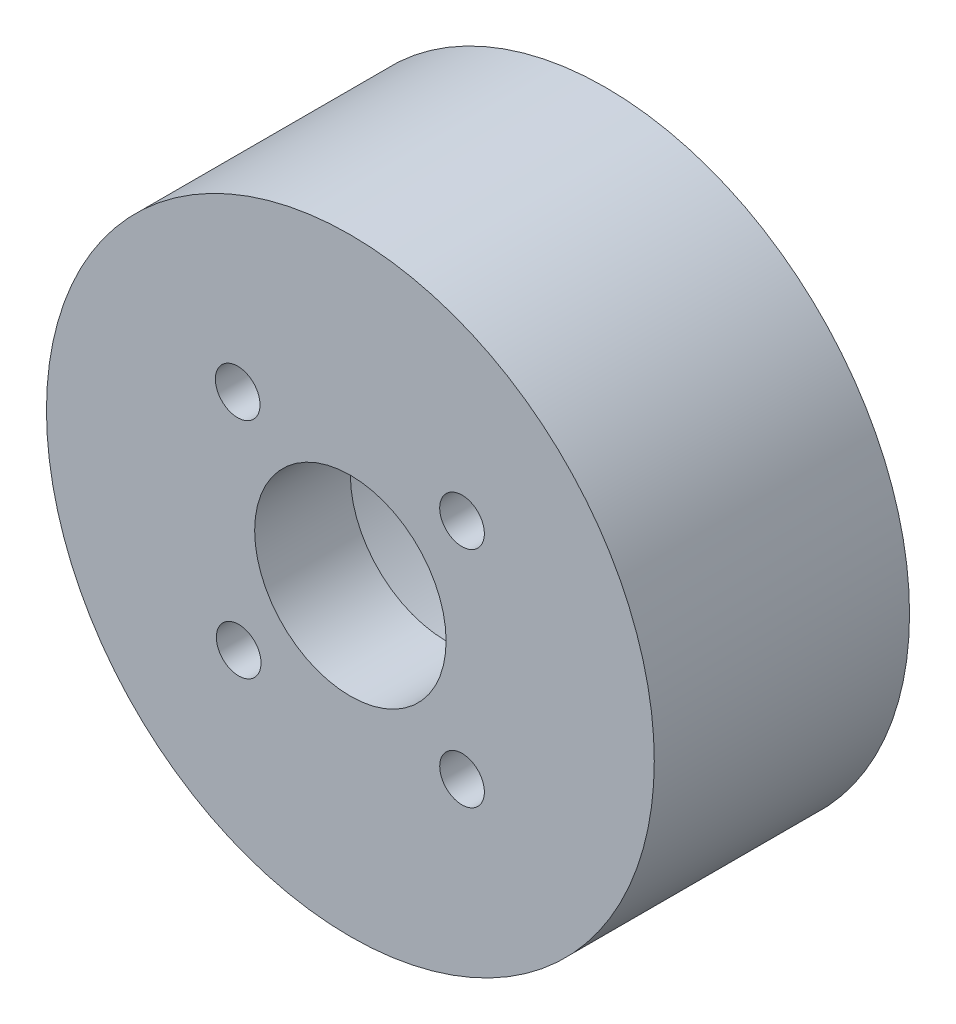
ISO-10303-21;
HEADER;
FILE_DESCRIPTION(('STEP AP214'),'2;1');
FILE_NAME('part.step','',(''),(''),'','','');
FILE_SCHEMA(('AUTOMOTIVE_DESIGN { 1 0 10303 214 1 1 1 1 }'));
ENDSEC;
DATA;
#1=APPLICATION_CONTEXT('core data for automotive mechanical design processes');
#2=APPLICATION_PROTOCOL_DEFINITION('international standard','automotive_design',2000,#1);
#3=PRODUCT_CONTEXT('',#1,'mechanical');
#4=PRODUCT('Part','Part','',(#3));
#5=PRODUCT_RELATED_PRODUCT_CATEGORY('part','',(#4));
#6=PRODUCT_DEFINITION_FORMATION('','',#4);
#7=PRODUCT_DEFINITION_CONTEXT('part definition',#1,'design');
#8=PRODUCT_DEFINITION('design','',#6,#7);
#9=PRODUCT_DEFINITION_SHAPE('','',#8);
#10=(LENGTH_UNIT() NAMED_UNIT(*) SI_UNIT(.MILLI.,.METRE.));
#11=(NAMED_UNIT(*) PLANE_ANGLE_UNIT() SI_UNIT($,.RADIAN.));
#12=(NAMED_UNIT(*) SI_UNIT($,.STERADIAN.) SOLID_ANGLE_UNIT());
#13=UNCERTAINTY_MEASURE_WITH_UNIT(LENGTH_MEASURE(1.E-05),#10,'distance_accuracy_value','');
#14=(GEOMETRIC_REPRESENTATION_CONTEXT(3) GLOBAL_UNCERTAINTY_ASSIGNED_CONTEXT((#13)) GLOBAL_UNIT_ASSIGNED_CONTEXT((#10,
#11,#12)) REPRESENTATION_CONTEXT('',''));
#15=CARTESIAN_POINT('',(0.,0.,0.));
#16=DIRECTION('',(0.,0.,1.));
#17=DIRECTION('',(1.,0.,0.));
#18=AXIS2_PLACEMENT_3D('',#15,#16,#17);
#19=CARTESIAN_POINT('',(0.,0.,16.));
#20=DIRECTION('',(0.,0.,-1.));
#21=DIRECTION('',(-1.,0.,0.));
#22=AXIS2_PLACEMENT_3D('',#19,#20,#21);
#23=CYLINDRICAL_SURFACE('',#22,19.05);
#24=CARTESIAN_POINT('',(0.,0.,16.));
#25=DIRECTION('',(0.,0.,1.));
#26=DIRECTION('',(1.,0.,0.));
#27=AXIS2_PLACEMENT_3D('',#24,#25,#26);
#28=CIRCLE('',#27,19.05);
#29=CARTESIAN_POINT('',(19.05,0.,16.));
#30=VERTEX_POINT('',#29);
#31=EDGE_CURVE('E10',#30,#30,#28,.T.);
#32=ORIENTED_EDGE('',*,*,#31,.F.);
#33=EDGE_LOOP('',(#32));
#34=FACE_BOUND('',#33,.T.);
#35=CARTESIAN_POINT('',(0.,0.,0.));
#36=DIRECTION('',(0.,0.,1.));
#37=DIRECTION('',(1.,0.,0.));
#38=AXIS2_PLACEMENT_3D('',#35,#36,#37);
#39=CIRCLE('',#38,19.05);
#40=CARTESIAN_POINT('',(19.05,0.,0.));
#41=VERTEX_POINT('',#40);
#42=EDGE_CURVE('E40',#41,#41,#39,.T.);
#43=ORIENTED_EDGE('',*,*,#42,.T.);
#44=EDGE_LOOP('',(#43));
#45=FACE_BOUND('',#44,.T.);
#46=ADVANCED_FACE('F37',(#34,#45),#23,.T.);
#47=CARTESIAN_POINT('',(0.,0.,16.));
#48=DIRECTION('',(0.,0.,1.));
#49=DIRECTION('',(1.,0.,0.));
#50=AXIS2_PLACEMENT_3D('',#47,#48,#49);
#51=PLANE('',#50);
#52=CARTESIAN_POINT('',(0.,0.,16.));
#53=DIRECTION('',(0.,0.,-1.));
#54=DIRECTION('',(-1.,0.,0.));
#55=AXIS2_PLACEMENT_3D('',#52,#53,#54);
#56=CIRCLE('',#55,6.);
#57=CARTESIAN_POINT('',(-6.,0.,16.));
#58=VERTEX_POINT('',#57);
#59=EDGE_CURVE('E119',#58,#58,#56,.T.);
#60=ORIENTED_EDGE('',*,*,#59,.T.);
#61=EDGE_LOOP('',(#60));
#62=FACE_BOUND('',#61,.T.);
#63=CARTESIAN_POINT('',(-7.,-7.,16.));
#64=DIRECTION('',(0.,0.,-1.));
#65=DIRECTION('',(-1.,0.,0.));
#66=AXIS2_PLACEMENT_3D('',#63,#64,#65);
#67=CIRCLE('',#66,1.4);
#68=CARTESIAN_POINT('',(-8.4,-7.,16.));
#69=VERTEX_POINT('',#68);
#70=EDGE_CURVE('E111',#69,#69,#67,.T.);
#71=ORIENTED_EDGE('',*,*,#70,.T.);
#72=EDGE_LOOP('',(#71));
#73=FACE_BOUND('',#72,.T.);
#74=CARTESIAN_POINT('',(7.,-7.,16.));
#75=DIRECTION('',(0.,0.,-1.));
#76=DIRECTION('',(-1.,0.,0.));
#77=AXIS2_PLACEMENT_3D('',#74,#75,#76);
#78=CIRCLE('',#77,1.4);
#79=CARTESIAN_POINT('',(5.6,-7.,16.));
#80=VERTEX_POINT('',#79);
#81=EDGE_CURVE('E103',#80,#80,#78,.T.);
#82=ORIENTED_EDGE('',*,*,#81,.T.);
#83=EDGE_LOOP('',(#82));
#84=FACE_BOUND('',#83,.T.);
#85=CARTESIAN_POINT('',(-7.06265710847331,6.98642658204118,16.));
#86=DIRECTION('',(0.,0.,-1.));
#87=DIRECTION('',(-1.,0.,0.));
#88=AXIS2_PLACEMENT_3D('',#85,#86,#87);
#89=CIRCLE('',#88,1.4);
#90=CARTESIAN_POINT('',(-8.46265710847331,6.98642658204118,16.));
#91=VERTEX_POINT('',#90);
#92=EDGE_CURVE('E95',#91,#91,#89,.T.);
#93=ORIENTED_EDGE('',*,*,#92,.T.);
#94=EDGE_LOOP('',(#93));
#95=FACE_BOUND('',#94,.T.);
#96=CARTESIAN_POINT('',(6.99800237830717,7.01997713227787,16.));
#97=DIRECTION('',(0.,0.,-1.));
#98=DIRECTION('',(-1.,0.,0.));
#99=AXIS2_PLACEMENT_3D('',#96,#97,#98);
#100=CIRCLE('',#99,1.4);
#101=CARTESIAN_POINT('',(5.59800237830717,7.01997713227787,16.));
#102=VERTEX_POINT('',#101);
#103=EDGE_CURVE('E72',#102,#102,#100,.T.);
#104=ORIENTED_EDGE('',*,*,#103,.T.);
#105=EDGE_LOOP('',(#104));
#106=FACE_BOUND('',#105,.T.);
#107=ORIENTED_EDGE('',*,*,#31,.T.);
#108=EDGE_LOOP('',(#107));
#109=FACE_BOUND('',#108,.T.);
#110=ADVANCED_FACE('F131',(#62,#73,#84,#95,#106,#109),#51,.T.);
#111=CARTESIAN_POINT('',(0.,0.,0.));
#112=DIRECTION('',(0.,0.,1.));
#113=DIRECTION('',(1.,0.,0.));
#114=AXIS2_PLACEMENT_3D('',#111,#112,#113);
#115=PLANE('',#114);
#116=CARTESIAN_POINT('',(0.,0.,0.));
#117=DIRECTION('',(0.,0.,-1.));
#118=DIRECTION('',(-1.,0.,0.));
#119=AXIS2_PLACEMENT_3D('',#116,#117,#118);
#120=CIRCLE('',#119,15.4);
#121=CARTESIAN_POINT('',(-15.4,0.,0.));
#122=VERTEX_POINT('',#121);
#123=EDGE_CURVE('E51',#122,#122,#120,.T.);
#124=ORIENTED_EDGE('',*,*,#123,.F.);
#125=EDGE_LOOP('',(#124));
#126=FACE_BOUND('',#125,.T.);
#127=ORIENTED_EDGE('',*,*,#42,.F.);
#128=EDGE_LOOP('',(#127));
#129=FACE_BOUND('',#128,.T.);
#130=ADVANCED_FACE('F159',(#126,#129),#115,.F.);
#131=CARTESIAN_POINT('',(0.,0.,10.));
#132=DIRECTION('',(0.,0.,-1.));
#133=DIRECTION('',(-1.,0.,0.));
#134=AXIS2_PLACEMENT_3D('',#131,#132,#133);
#135=CYLINDRICAL_SURFACE('',#134,15.4);
#136=CARTESIAN_POINT('',(0.,0.,10.));
#137=DIRECTION('',(0.,0.,-1.));
#138=DIRECTION('',(-1.,0.,0.));
#139=AXIS2_PLACEMENT_3D('',#136,#137,#138);
#140=CIRCLE('',#139,15.4);
#141=CARTESIAN_POINT('',(-15.4,0.,10.));
#142=VERTEX_POINT('',#141);
#143=EDGE_CURVE('E49',#142,#142,#140,.T.);
#144=ORIENTED_EDGE('',*,*,#143,.F.);
#145=EDGE_LOOP('',(#144));
#146=FACE_BOUND('',#145,.T.);
#147=ORIENTED_EDGE('',*,*,#123,.T.);
#148=EDGE_LOOP('',(#147));
#149=FACE_BOUND('',#148,.T.);
#150=ADVANCED_FACE('F145',(#146,#149),#135,.F.);
#151=CARTESIAN_POINT('',(0.,0.,10.));
#152=DIRECTION('',(0.,0.,-1.));
#153=DIRECTION('',(-1.,0.,0.));
#154=AXIS2_PLACEMENT_3D('',#151,#152,#153);
#155=PLANE('',#154);
#156=CARTESIAN_POINT('',(0.,0.,10.));
#157=DIRECTION('',(0.,0.,-1.));
#158=DIRECTION('',(-1.,0.,0.));
#159=AXIS2_PLACEMENT_3D('',#156,#157,#158);
#160=CIRCLE('',#159,6.);
#161=CARTESIAN_POINT('',(-6.,0.,10.));
#162=VERTEX_POINT('',#161);
#163=EDGE_CURVE('E123',#162,#162,#160,.T.);
#164=ORIENTED_EDGE('',*,*,#163,.F.);
#165=EDGE_LOOP('',(#164));
#166=FACE_BOUND('',#165,.T.);
#167=CARTESIAN_POINT('',(7.,-7.,10.));
#168=DIRECTION('',(0.,0.,-1.));
#169=DIRECTION('',(-1.,0.,0.));
#170=AXIS2_PLACEMENT_3D('',#167,#168,#169);
#171=CIRCLE('',#170,2.5);
#172=CARTESIAN_POINT('',(4.5,-7.,10.));
#173=VERTEX_POINT('',#172);
#174=EDGE_CURVE('E67',#173,#173,#171,.T.);
#175=ORIENTED_EDGE('',*,*,#174,.F.);
#176=EDGE_LOOP('',(#175));
#177=FACE_BOUND('',#176,.T.);
#178=CARTESIAN_POINT('',(-7.,-7.,10.));
#179=DIRECTION('',(0.,0.,-1.));
#180=DIRECTION('',(-1.,0.,0.));
#181=AXIS2_PLACEMENT_3D('',#178,#179,#180);
#182=CIRCLE('',#181,2.5);
#183=CARTESIAN_POINT('',(-9.5,-7.,10.));
#184=VERTEX_POINT('',#183);
#185=EDGE_CURVE('E76',#184,#184,#182,.T.);
#186=ORIENTED_EDGE('',*,*,#185,.F.);
#187=EDGE_LOOP('',(#186));
#188=FACE_BOUND('',#187,.T.);
#189=CARTESIAN_POINT('',(-7.,7.,10.));
#190=DIRECTION('',(0.,0.,-1.));
#191=DIRECTION('',(-1.,0.,0.));
#192=AXIS2_PLACEMENT_3D('',#189,#190,#191);
#193=CIRCLE('',#192,2.5);
#194=CARTESIAN_POINT('',(-9.5,7.,10.));
#195=VERTEX_POINT('',#194);
#196=EDGE_CURVE('E84',#195,#195,#193,.T.);
#197=ORIENTED_EDGE('',*,*,#196,.F.);
#198=EDGE_LOOP('',(#197));
#199=FACE_BOUND('',#198,.T.);
#200=CARTESIAN_POINT('',(7.,7.,10.));
#201=DIRECTION('',(0.,0.,-1.));
#202=DIRECTION('',(-1.,0.,0.));
#203=AXIS2_PLACEMENT_3D('',#200,#201,#202);
#204=CIRCLE('',#203,2.5);
#205=CARTESIAN_POINT('',(4.5,7.,10.));
#206=VERTEX_POINT('',#205);
#207=EDGE_CURVE('E59',#206,#206,#204,.T.);
#208=ORIENTED_EDGE('',*,*,#207,.F.);
#209=EDGE_LOOP('',(#208));
#210=FACE_BOUND('',#209,.T.);
#211=ORIENTED_EDGE('',*,*,#143,.T.);
#212=EDGE_LOOP('',(#211));
#213=FACE_BOUND('',#212,.T.);
#214=ADVANCED_FACE('F141',(#166,#177,#188,#199,#210,#213),#155,.T.);
#215=CARTESIAN_POINT('',(7.,7.,11.4));
#216=DIRECTION('',(0.,0.,-1.));
#217=DIRECTION('',(-1.,0.,0.));
#218=AXIS2_PLACEMENT_3D('',#215,#216,#217);
#219=CYLINDRICAL_SURFACE('',#218,2.5);
#220=CARTESIAN_POINT('',(7.,7.,11.4));
#221=DIRECTION('',(0.,0.,-1.));
#222=DIRECTION('',(-1.,0.,0.));
#223=AXIS2_PLACEMENT_3D('',#220,#221,#222);
#224=CIRCLE('',#223,2.5);
#225=CARTESIAN_POINT('',(4.5,7.,11.4));
#226=VERTEX_POINT('',#225);
#227=EDGE_CURVE('E55',#226,#226,#224,.T.);
#228=ORIENTED_EDGE('',*,*,#227,.F.);
#229=EDGE_LOOP('',(#228));
#230=FACE_BOUND('',#229,.T.);
#231=ORIENTED_EDGE('',*,*,#207,.T.);
#232=EDGE_LOOP('',(#231));
#233=FACE_BOUND('',#232,.T.);
#234=ADVANCED_FACE('F144',(#230,#233),#219,.F.);
#235=CARTESIAN_POINT('',(7.,7.,11.4));
#236=DIRECTION('',(0.,0.,-1.));
#237=DIRECTION('',(-1.,0.,0.));
#238=AXIS2_PLACEMENT_3D('',#235,#236,#237);
#239=PLANE('',#238);
#240=CARTESIAN_POINT('',(6.99800237830717,7.01997713227787,11.4));
#241=DIRECTION('',(0.,0.,-1.));
#242=DIRECTION('',(-1.,0.,0.));
#243=AXIS2_PLACEMENT_3D('',#240,#241,#242);
#244=CIRCLE('',#243,1.4);
#245=CARTESIAN_POINT('',(5.59800237830717,7.01997713227787,11.4));
#246=VERTEX_POINT('',#245);
#247=EDGE_CURVE('E91',#246,#246,#244,.T.);
#248=ORIENTED_EDGE('',*,*,#247,.F.);
#249=EDGE_LOOP('',(#248));
#250=FACE_BOUND('',#249,.T.);
#251=ORIENTED_EDGE('',*,*,#227,.T.);
#252=EDGE_LOOP('',(#251));
#253=FACE_BOUND('',#252,.T.);
#254=ADVANCED_FACE('F178',(#250,#253),#239,.T.);
#255=CARTESIAN_POINT('',(-7.,7.,11.4));
#256=DIRECTION('',(0.,0.,-1.));
#257=DIRECTION('',(-1.,0.,0.));
#258=AXIS2_PLACEMENT_3D('',#255,#256,#257);
#259=CYLINDRICAL_SURFACE('',#258,2.5);
#260=CARTESIAN_POINT('',(-7.,7.,11.4));
#261=DIRECTION('',(0.,0.,-1.));
#262=DIRECTION('',(-1.,0.,0.));
#263=AXIS2_PLACEMENT_3D('',#260,#261,#262);
#264=CIRCLE('',#263,2.5);
#265=CARTESIAN_POINT('',(-9.5,7.,11.4));
#266=VERTEX_POINT('',#265);
#267=EDGE_CURVE('E63',#266,#266,#264,.T.);
#268=ORIENTED_EDGE('',*,*,#267,.F.);
#269=EDGE_LOOP('',(#268));
#270=FACE_BOUND('',#269,.T.);
#271=ORIENTED_EDGE('',*,*,#196,.T.);
#272=EDGE_LOOP('',(#271));
#273=FACE_BOUND('',#272,.T.);
#274=ADVANCED_FACE('F182',(#270,#273),#259,.F.);
#275=CARTESIAN_POINT('',(-7.,7.,11.4));
#276=DIRECTION('',(0.,0.,-1.));
#277=DIRECTION('',(-1.,0.,0.));
#278=AXIS2_PLACEMENT_3D('',#275,#276,#277);
#279=PLANE('',#278);
#280=CARTESIAN_POINT('',(-7.06265710847331,6.98642658204118,11.4));
#281=DIRECTION('',(0.,0.,-1.));
#282=DIRECTION('',(-1.,0.,0.));
#283=AXIS2_PLACEMENT_3D('',#280,#281,#282);
#284=CIRCLE('',#283,1.4);
#285=CARTESIAN_POINT('',(-8.46265710847331,6.98642658204118,11.4));
#286=VERTEX_POINT('',#285);
#287=EDGE_CURVE('E99',#286,#286,#284,.T.);
#288=ORIENTED_EDGE('',*,*,#287,.F.);
#289=EDGE_LOOP('',(#288));
#290=FACE_BOUND('',#289,.T.);
#291=ORIENTED_EDGE('',*,*,#267,.T.);
#292=EDGE_LOOP('',(#291));
#293=FACE_BOUND('',#292,.T.);
#294=ADVANCED_FACE('F197',(#290,#293),#279,.T.);
#295=CARTESIAN_POINT('',(-7.,-7.,11.4));
#296=DIRECTION('',(0.,0.,-1.));
#297=DIRECTION('',(-1.,0.,0.));
#298=AXIS2_PLACEMENT_3D('',#295,#296,#297);
#299=CYLINDRICAL_SURFACE('',#298,2.5);
#300=CARTESIAN_POINT('',(-7.,-7.,11.4));
#301=DIRECTION('',(0.,0.,-1.));
#302=DIRECTION('',(-1.,0.,0.));
#303=AXIS2_PLACEMENT_3D('',#300,#301,#302);
#304=CIRCLE('',#303,2.5);
#305=CARTESIAN_POINT('',(-9.5,-7.,11.4));
#306=VERTEX_POINT('',#305);
#307=EDGE_CURVE('E80',#306,#306,#304,.T.);
#308=ORIENTED_EDGE('',*,*,#307,.F.);
#309=EDGE_LOOP('',(#308));
#310=FACE_BOUND('',#309,.T.);
#311=ORIENTED_EDGE('',*,*,#185,.T.);
#312=EDGE_LOOP('',(#311));
#313=FACE_BOUND('',#312,.T.);
#314=ADVANCED_FACE('F194',(#310,#313),#299,.F.);
#315=CARTESIAN_POINT('',(-7.,-7.,11.4));
#316=DIRECTION('',(0.,0.,-1.));
#317=DIRECTION('',(-1.,0.,0.));
#318=AXIS2_PLACEMENT_3D('',#315,#316,#317);
#319=PLANE('',#318);
#320=CARTESIAN_POINT('',(-7.,-7.,11.4));
#321=DIRECTION('',(0.,0.,-1.));
#322=DIRECTION('',(-1.,0.,0.));
#323=AXIS2_PLACEMENT_3D('',#320,#321,#322);
#324=CIRCLE('',#323,1.4);
#325=CARTESIAN_POINT('',(-8.4,-7.,11.4));
#326=VERTEX_POINT('',#325);
#327=EDGE_CURVE('E115',#326,#326,#324,.T.);
#328=ORIENTED_EDGE('',*,*,#327,.F.);
#329=EDGE_LOOP('',(#328));
#330=FACE_BOUND('',#329,.T.);
#331=ORIENTED_EDGE('',*,*,#307,.T.);
#332=EDGE_LOOP('',(#331));
#333=FACE_BOUND('',#332,.T.);
#334=ADVANCED_FACE('F188',(#330,#333),#319,.T.);
#335=CARTESIAN_POINT('',(7.,-7.,11.4));
#336=DIRECTION('',(0.,0.,-1.));
#337=DIRECTION('',(-1.,0.,0.));
#338=AXIS2_PLACEMENT_3D('',#335,#336,#337);
#339=CYLINDRICAL_SURFACE('',#338,2.5);
#340=CARTESIAN_POINT('',(7.,-7.,11.4));
#341=DIRECTION('',(0.,0.,-1.));
#342=DIRECTION('',(-1.,0.,0.));
#343=AXIS2_PLACEMENT_3D('',#340,#341,#342);
#344=CIRCLE('',#343,2.5);
#345=CARTESIAN_POINT('',(4.5,-7.,11.4));
#346=VERTEX_POINT('',#345);
#347=EDGE_CURVE('E71',#346,#346,#344,.T.);
#348=ORIENTED_EDGE('',*,*,#347,.F.);
#349=EDGE_LOOP('',(#348));
#350=FACE_BOUND('',#349,.T.);
#351=ORIENTED_EDGE('',*,*,#174,.T.);
#352=EDGE_LOOP('',(#351));
#353=FACE_BOUND('',#352,.T.);
#354=ADVANCED_FACE('F184',(#350,#353),#339,.F.);
#355=CARTESIAN_POINT('',(7.,-7.,11.4));
#356=DIRECTION('',(0.,0.,-1.));
#357=DIRECTION('',(-1.,0.,0.));
#358=AXIS2_PLACEMENT_3D('',#355,#356,#357);
#359=PLANE('',#358);
#360=CARTESIAN_POINT('',(7.,-7.,11.4));
#361=DIRECTION('',(0.,0.,-1.));
#362=DIRECTION('',(-1.,0.,0.));
#363=AXIS2_PLACEMENT_3D('',#360,#361,#362);
#364=CIRCLE('',#363,1.4);
#365=CARTESIAN_POINT('',(5.6,-7.,11.4));
#366=VERTEX_POINT('',#365);
#367=EDGE_CURVE('E107',#366,#366,#364,.T.);
#368=ORIENTED_EDGE('',*,*,#367,.F.);
#369=EDGE_LOOP('',(#368));
#370=FACE_BOUND('',#369,.T.);
#371=ORIENTED_EDGE('',*,*,#347,.T.);
#372=EDGE_LOOP('',(#371));
#373=FACE_BOUND('',#372,.T.);
#374=ADVANCED_FACE('F187',(#370,#373),#359,.T.);
#375=CARTESIAN_POINT('',(6.99800237830717,7.01997713227787,16.));
#376=DIRECTION('',(0.,0.,-1.));
#377=DIRECTION('',(-1.,0.,0.));
#378=AXIS2_PLACEMENT_3D('',#375,#376,#377);
#379=CYLINDRICAL_SURFACE('',#378,1.4);
#380=ORIENTED_EDGE('',*,*,#103,.F.);
#381=EDGE_LOOP('',(#380));
#382=FACE_BOUND('',#381,.T.);
#383=ORIENTED_EDGE('',*,*,#247,.T.);
#384=EDGE_LOOP('',(#383));
#385=FACE_BOUND('',#384,.T.);
#386=ADVANCED_FACE('F192',(#382,#385),#379,.F.);
#387=CARTESIAN_POINT('',(-7.06265710847331,6.98642658204118,16.));
#388=DIRECTION('',(0.,0.,-1.));
#389=DIRECTION('',(-1.,0.,0.));
#390=AXIS2_PLACEMENT_3D('',#387,#388,#389);
#391=CYLINDRICAL_SURFACE('',#390,1.4);
#392=ORIENTED_EDGE('',*,*,#92,.F.);
#393=EDGE_LOOP('',(#392));
#394=FACE_BOUND('',#393,.T.);
#395=ORIENTED_EDGE('',*,*,#287,.T.);
#396=EDGE_LOOP('',(#395));
#397=FACE_BOUND('',#396,.T.);
#398=ADVANCED_FACE('F210',(#394,#397),#391,.F.);
#399=CARTESIAN_POINT('',(7.,-7.,16.));
#400=DIRECTION('',(0.,0.,-1.));
#401=DIRECTION('',(-1.,0.,0.));
#402=AXIS2_PLACEMENT_3D('',#399,#400,#401);
#403=CYLINDRICAL_SURFACE('',#402,1.4);
#404=ORIENTED_EDGE('',*,*,#81,.F.);
#405=EDGE_LOOP('',(#404));
#406=FACE_BOUND('',#405,.T.);
#407=ORIENTED_EDGE('',*,*,#367,.T.);
#408=EDGE_LOOP('',(#407));
#409=FACE_BOUND('',#408,.T.);
#410=ADVANCED_FACE('F214',(#406,#409),#403,.F.);
#411=CARTESIAN_POINT('',(-7.,-7.,16.));
#412=DIRECTION('',(0.,0.,-1.));
#413=DIRECTION('',(-1.,0.,0.));
#414=AXIS2_PLACEMENT_3D('',#411,#412,#413);
#415=CYLINDRICAL_SURFACE('',#414,1.4);
#416=ORIENTED_EDGE('',*,*,#70,.F.);
#417=EDGE_LOOP('',(#416));
#418=FACE_BOUND('',#417,.T.);
#419=ORIENTED_EDGE('',*,*,#327,.T.);
#420=EDGE_LOOP('',(#419));
#421=FACE_BOUND('',#420,.T.);
#422=ADVANCED_FACE('F137',(#418,#421),#415,.F.);
#423=CARTESIAN_POINT('',(0.,0.,16.));
#424=DIRECTION('',(0.,0.,-1.));
#425=DIRECTION('',(-1.,0.,0.));
#426=AXIS2_PLACEMENT_3D('',#423,#424,#425);
#427=CYLINDRICAL_SURFACE('',#426,6.);
#428=ORIENTED_EDGE('',*,*,#59,.F.);
#429=EDGE_LOOP('',(#428));
#430=FACE_BOUND('',#429,.T.);
#431=ORIENTED_EDGE('',*,*,#163,.T.);
#432=EDGE_LOOP('',(#431));
#433=FACE_BOUND('',#432,.T.);
#434=ADVANCED_FACE('F134',(#430,#433),#427,.F.);
#435=CLOSED_SHELL('',(#46,#110,#130,#150,#214,#234,#254,#274,#294,#314,#334,#354,#374,#386,#398,
#410,#422,#434));
#436=MANIFOLD_SOLID_BREP('B2',#435);
#437=ADVANCED_BREP_SHAPE_REPRESENTATION('',(#18,#436),#14);
#438=SHAPE_DEFINITION_REPRESENTATION(#9,#437);
ENDSEC;
END-ISO-10303-21;
